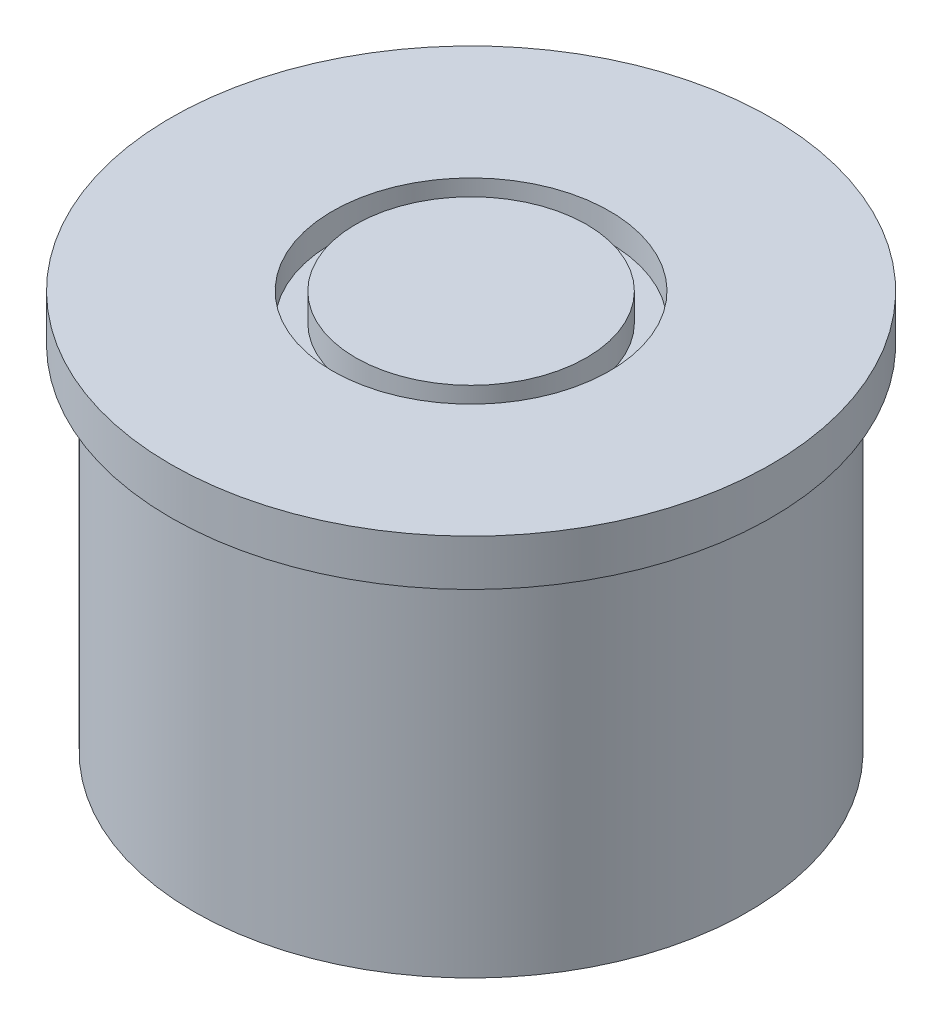
ISO-10303-21;
HEADER;
FILE_DESCRIPTION(('STEP AP214'),'2;1');
FILE_NAME('part.step','',(''),(''),'','','');
FILE_SCHEMA(('AUTOMOTIVE_DESIGN { 1 0 10303 214 1 1 1 1 }'));
ENDSEC;
DATA;
#1=APPLICATION_CONTEXT('core data for automotive mechanical design processes');
#2=APPLICATION_PROTOCOL_DEFINITION('international standard','automotive_design',2000,#1);
#3=PRODUCT_CONTEXT('',#1,'mechanical');
#4=PRODUCT('Part','Part','',(#3));
#5=PRODUCT_RELATED_PRODUCT_CATEGORY('part','',(#4));
#6=PRODUCT_DEFINITION_FORMATION('','',#4);
#7=PRODUCT_DEFINITION_CONTEXT('part definition',#1,'design');
#8=PRODUCT_DEFINITION('design','',#6,#7);
#9=PRODUCT_DEFINITION_SHAPE('','',#8);
#10=(LENGTH_UNIT() NAMED_UNIT(*) SI_UNIT(.MILLI.,.METRE.));
#11=(NAMED_UNIT(*) PLANE_ANGLE_UNIT() SI_UNIT($,.RADIAN.));
#12=(NAMED_UNIT(*) SI_UNIT($,.STERADIAN.) SOLID_ANGLE_UNIT());
#13=UNCERTAINTY_MEASURE_WITH_UNIT(LENGTH_MEASURE(1.E-05),#10,'distance_accuracy_value','');
#14=(GEOMETRIC_REPRESENTATION_CONTEXT(3) GLOBAL_UNCERTAINTY_ASSIGNED_CONTEXT((#13)) GLOBAL_UNIT_ASSIGNED_CONTEXT((#10,
#11,#12)) REPRESENTATION_CONTEXT('',''));
#15=CARTESIAN_POINT('',(0.,0.,0.));
#16=DIRECTION('',(0.,0.,1.));
#17=DIRECTION('',(1.,0.,0.));
#18=AXIS2_PLACEMENT_3D('',#15,#16,#17);
#19=CARTESIAN_POINT('',(0.,-43.19,0.));
#20=DIRECTION('',(0.,1.,0.));
#21=DIRECTION('',(0.,0.,1.));
#22=AXIS2_PLACEMENT_3D('',#19,#20,#21);
#23=CYLINDRICAL_SURFACE('',#22,30.);
#24=CARTESIAN_POINT('',(0.,-43.19,0.));
#25=DIRECTION('',(0.,1.,0.));
#26=DIRECTION('',(0.,0.,1.));
#27=AXIS2_PLACEMENT_3D('',#24,#25,#26);
#28=CIRCLE('',#27,30.);
#29=CARTESIAN_POINT('',(0.,-43.19,30.));
#30=VERTEX_POINT('',#29);
#31=EDGE_CURVE('E10',#30,#30,#28,.T.);
#32=ORIENTED_EDGE('',*,*,#31,.T.);
#33=EDGE_LOOP('',(#32));
#34=FACE_BOUND('',#33,.T.);
#35=CARTESIAN_POINT('',(0.,-5.,0.));
#36=DIRECTION('',(0.,1.,0.));
#37=DIRECTION('',(0.,0.,1.));
#38=AXIS2_PLACEMENT_3D('',#35,#36,#37);
#39=CIRCLE('',#38,30.);
#40=CARTESIAN_POINT('',(0.,-5.,30.));
#41=VERTEX_POINT('',#40);
#42=EDGE_CURVE('E51',#41,#41,#39,.T.);
#43=ORIENTED_EDGE('',*,*,#42,.F.);
#44=EDGE_LOOP('',(#43));
#45=FACE_BOUND('',#44,.T.);
#46=ADVANCED_FACE('F36',(#34,#45),#23,.T.);
#47=CARTESIAN_POINT('',(0.,-43.19,0.));
#48=DIRECTION('',(0.,1.,0.));
#49=DIRECTION('',(0.,0.,1.));
#50=AXIS2_PLACEMENT_3D('',#47,#48,#49);
#51=PLANE('',#50);
#52=CARTESIAN_POINT('',(0.,-43.19,0.));
#53=DIRECTION('',(0.,-1.,0.));
#54=DIRECTION('',(0.,0.,-1.));
#55=AXIS2_PLACEMENT_3D('',#52,#53,#54);
#56=CIRCLE('',#55,8.);
#57=CARTESIAN_POINT('',(0.,-43.19,-8.));
#58=VERTEX_POINT('',#57);
#59=EDGE_CURVE('E56',#58,#58,#56,.T.);
#60=ORIENTED_EDGE('',*,*,#59,.F.);
#61=EDGE_LOOP('',(#60));
#62=FACE_BOUND('',#61,.T.);
#63=ORIENTED_EDGE('',*,*,#31,.F.);
#64=EDGE_LOOP('',(#63));
#65=FACE_BOUND('',#64,.T.);
#66=ADVANCED_FACE('F106',(#62,#65),#51,.F.);
#67=CARTESIAN_POINT('',(0.,-5.,0.));
#68=DIRECTION('',(0.,1.,0.));
#69=DIRECTION('',(0.,0.,1.));
#70=AXIS2_PLACEMENT_3D('',#67,#68,#69);
#71=CYLINDRICAL_SURFACE('',#70,32.5);
#72=CARTESIAN_POINT('',(0.,-5.,0.));
#73=DIRECTION('',(0.,1.,0.));
#74=DIRECTION('',(0.,0.,1.));
#75=AXIS2_PLACEMENT_3D('',#72,#73,#74);
#76=CIRCLE('',#75,32.5);
#77=CARTESIAN_POINT('',(0.,-5.,32.5));
#78=VERTEX_POINT('',#77);
#79=EDGE_CURVE('E42',#78,#78,#76,.T.);
#80=ORIENTED_EDGE('',*,*,#79,.T.);
#81=EDGE_LOOP('',(#80));
#82=FACE_BOUND('',#81,.T.);
#83=CARTESIAN_POINT('',(0.,0.,0.));
#84=DIRECTION('',(0.,1.,0.));
#85=DIRECTION('',(0.,0.,1.));
#86=AXIS2_PLACEMENT_3D('',#83,#84,#85);
#87=CIRCLE('',#86,32.5);
#88=CARTESIAN_POINT('',(0.,0.,32.5));
#89=VERTEX_POINT('',#88);
#90=EDGE_CURVE('E46',#89,#89,#87,.T.);
#91=ORIENTED_EDGE('',*,*,#90,.F.);
#92=EDGE_LOOP('',(#91));
#93=FACE_BOUND('',#92,.T.);
#94=ADVANCED_FACE('F104',(#82,#93),#71,.T.);
#95=CARTESIAN_POINT('',(0.,-5.,0.));
#96=DIRECTION('',(0.,1.,0.));
#97=DIRECTION('',(0.,0.,1.));
#98=AXIS2_PLACEMENT_3D('',#95,#96,#97);
#99=PLANE('',#98);
#100=ORIENTED_EDGE('',*,*,#42,.T.);
#101=EDGE_LOOP('',(#100));
#102=FACE_BOUND('',#101,.T.);
#103=ORIENTED_EDGE('',*,*,#79,.F.);
#104=EDGE_LOOP('',(#103));
#105=FACE_BOUND('',#104,.T.);
#106=ADVANCED_FACE('F100',(#102,#105),#99,.F.);
#107=CARTESIAN_POINT('',(0.,0.,0.));
#108=DIRECTION('',(0.,1.,0.));
#109=DIRECTION('',(0.,0.,1.));
#110=AXIS2_PLACEMENT_3D('',#107,#108,#109);
#111=PLANE('',#110);
#112=CARTESIAN_POINT('',(0.,0.,0.));
#113=DIRECTION('',(0.,1.,0.));
#114=DIRECTION('',(0.,0.,1.));
#115=AXIS2_PLACEMENT_3D('',#112,#113,#114);
#116=CIRCLE('',#115,15.);
#117=CARTESIAN_POINT('',(0.,0.,15.));
#118=VERTEX_POINT('',#117);
#119=EDGE_CURVE('E68',#118,#118,#116,.T.);
#120=ORIENTED_EDGE('',*,*,#119,.F.);
#121=EDGE_LOOP('',(#120));
#122=FACE_BOUND('',#121,.T.);
#123=ORIENTED_EDGE('',*,*,#90,.T.);
#124=EDGE_LOOP('',(#123));
#125=FACE_BOUND('',#124,.T.);
#126=ADVANCED_FACE('F96',(#122,#125),#111,.T.);
#127=CARTESIAN_POINT('',(0.,-41.19,0.));
#128=DIRECTION('',(0.,-1.,0.));
#129=DIRECTION('',(0.,0.,-1.));
#130=AXIS2_PLACEMENT_3D('',#127,#128,#129);
#131=CYLINDRICAL_SURFACE('',#130,8.);
#132=CARTESIAN_POINT('',(0.,-41.19,0.));
#133=DIRECTION('',(0.,-1.,0.));
#134=DIRECTION('',(0.,0.,-1.));
#135=AXIS2_PLACEMENT_3D('',#132,#133,#134);
#136=CIRCLE('',#135,8.);
#137=CARTESIAN_POINT('',(0.,-41.19,-8.));
#138=VERTEX_POINT('',#137);
#139=EDGE_CURVE('E55',#138,#138,#136,.T.);
#140=ORIENTED_EDGE('',*,*,#139,.F.);
#141=EDGE_LOOP('',(#140));
#142=FACE_BOUND('',#141,.T.);
#143=ORIENTED_EDGE('',*,*,#59,.T.);
#144=EDGE_LOOP('',(#143));
#145=FACE_BOUND('',#144,.T.);
#146=ADVANCED_FACE('F99',(#142,#145),#131,.F.);
#147=CARTESIAN_POINT('',(0.,-41.19,0.));
#148=DIRECTION('',(0.,-1.,0.));
#149=DIRECTION('',(0.,0.,-1.));
#150=AXIS2_PLACEMENT_3D('',#147,#148,#149);
#151=PLANE('',#150);
#152=CARTESIAN_POINT('',(0.,-41.19,0.));
#153=DIRECTION('',(0.,-1.,0.));
#154=DIRECTION('',(0.,0.,-1.));
#155=AXIS2_PLACEMENT_3D('',#152,#153,#154);
#156=CIRCLE('',#155,6.);
#157=CARTESIAN_POINT('',(0.,-41.19,-6.));
#158=VERTEX_POINT('',#157);
#159=EDGE_CURVE('E59',#158,#158,#156,.T.);
#160=ORIENTED_EDGE('',*,*,#159,.F.);
#161=EDGE_LOOP('',(#160));
#162=FACE_BOUND('',#161,.T.);
#163=ORIENTED_EDGE('',*,*,#139,.T.);
#164=EDGE_LOOP('',(#163));
#165=FACE_BOUND('',#164,.T.);
#166=ADVANCED_FACE('F139',(#162,#165),#151,.T.);
#167=CARTESIAN_POINT('',(0.,-41.19,0.));
#168=DIRECTION('',(0.,-1.,0.));
#169=DIRECTION('',(0.,0.,-1.));
#170=AXIS2_PLACEMENT_3D('',#167,#168,#169);
#171=CYLINDRICAL_SURFACE('',#170,6.);
#172=ORIENTED_EDGE('',*,*,#159,.T.);
#173=EDGE_LOOP('',(#172));
#174=FACE_BOUND('',#173,.T.);
#175=CARTESIAN_POINT('',(0.,-43.19,0.));
#176=DIRECTION('',(0.,-1.,0.));
#177=DIRECTION('',(0.,0.,-1.));
#178=AXIS2_PLACEMENT_3D('',#175,#176,#177);
#179=CIRCLE('',#178,6.);
#180=CARTESIAN_POINT('',(0.,-43.19,-6.));
#181=VERTEX_POINT('',#180);
#182=EDGE_CURVE('E62',#181,#181,#179,.T.);
#183=ORIENTED_EDGE('',*,*,#182,.F.);
#184=EDGE_LOOP('',(#183));
#185=FACE_BOUND('',#184,.T.);
#186=ADVANCED_FACE('F151',(#174,#185),#171,.T.);
#187=ORIENTED_EDGE('',*,*,#182,.T.);
#188=EDGE_LOOP('',(#187));
#189=FACE_BOUND('',#188,.T.);
#190=ADVANCED_FACE('F92',(#189),#51,.F.);
#191=CARTESIAN_POINT('',(0.,-3.,0.));
#192=DIRECTION('',(0.,1.,0.));
#193=DIRECTION('',(0.,0.,1.));
#194=AXIS2_PLACEMENT_3D('',#191,#192,#193);
#195=CYLINDRICAL_SURFACE('',#194,15.);
#196=CARTESIAN_POINT('',(0.,-3.,0.));
#197=DIRECTION('',(0.,1.,0.));
#198=DIRECTION('',(0.,0.,1.));
#199=AXIS2_PLACEMENT_3D('',#196,#197,#198);
#200=CIRCLE('',#199,15.);
#201=CARTESIAN_POINT('',(0.,-3.,15.));
#202=VERTEX_POINT('',#201);
#203=EDGE_CURVE('E65',#202,#202,#200,.T.);
#204=ORIENTED_EDGE('',*,*,#203,.F.);
#205=EDGE_LOOP('',(#204));
#206=FACE_BOUND('',#205,.T.);
#207=ORIENTED_EDGE('',*,*,#119,.T.);
#208=EDGE_LOOP('',(#207));
#209=FACE_BOUND('',#208,.T.);
#210=ADVANCED_FACE('F86',(#206,#209),#195,.F.);
#211=CARTESIAN_POINT('',(0.,-3.,0.));
#212=DIRECTION('',(0.,1.,0.));
#213=DIRECTION('',(0.,0.,1.));
#214=AXIS2_PLACEMENT_3D('',#211,#212,#213);
#215=PLANE('',#214);
#216=CARTESIAN_POINT('',(0.,-3.,0.));
#217=DIRECTION('',(0.,1.,0.));
#218=DIRECTION('',(0.,0.,1.));
#219=AXIS2_PLACEMENT_3D('',#216,#217,#218);
#220=CIRCLE('',#219,12.5);
#221=CARTESIAN_POINT('',(0.,-3.,12.5));
#222=VERTEX_POINT('',#221);
#223=EDGE_CURVE('E71',#222,#222,#220,.T.);
#224=ORIENTED_EDGE('',*,*,#223,.F.);
#225=EDGE_LOOP('',(#224));
#226=FACE_BOUND('',#225,.T.);
#227=ORIENTED_EDGE('',*,*,#203,.T.);
#228=EDGE_LOOP('',(#227));
#229=FACE_BOUND('',#228,.T.);
#230=ADVANCED_FACE('F83',(#226,#229),#215,.T.);
#231=CARTESIAN_POINT('',(0.,-3.,0.));
#232=DIRECTION('',(0.,1.,0.));
#233=DIRECTION('',(0.,0.,1.));
#234=AXIS2_PLACEMENT_3D('',#231,#232,#233);
#235=CYLINDRICAL_SURFACE('',#234,12.5);
#236=ORIENTED_EDGE('',*,*,#223,.T.);
#237=EDGE_LOOP('',(#236));
#238=FACE_BOUND('',#237,.T.);
#239=CARTESIAN_POINT('',(0.,0.,0.));
#240=DIRECTION('',(0.,1.,0.));
#241=DIRECTION('',(0.,0.,1.));
#242=AXIS2_PLACEMENT_3D('',#239,#240,#241);
#243=CIRCLE('',#242,12.5);
#244=CARTESIAN_POINT('',(0.,0.,12.5));
#245=VERTEX_POINT('',#244);
#246=EDGE_CURVE('E74',#245,#245,#243,.T.);
#247=ORIENTED_EDGE('',*,*,#246,.F.);
#248=EDGE_LOOP('',(#247));
#249=FACE_BOUND('',#248,.T.);
#250=ADVANCED_FACE('F80',(#238,#249),#235,.T.);
#251=ORIENTED_EDGE('',*,*,#246,.T.);
#252=EDGE_LOOP('',(#251));
#253=FACE_BOUND('',#252,.T.);
#254=ADVANCED_FACE('F101',(#253),#111,.T.);
#255=CLOSED_SHELL('',(#46,#66,#94,#106,#126,#146,#166,#186,#190,#210,#230,#250,#254));
#256=MANIFOLD_SOLID_BREP('B2',#255);
#257=ADVANCED_BREP_SHAPE_REPRESENTATION('',(#18,#256),#14);
#258=SHAPE_DEFINITION_REPRESENTATION(#9,#257);
ENDSEC;
END-ISO-10303-21;
